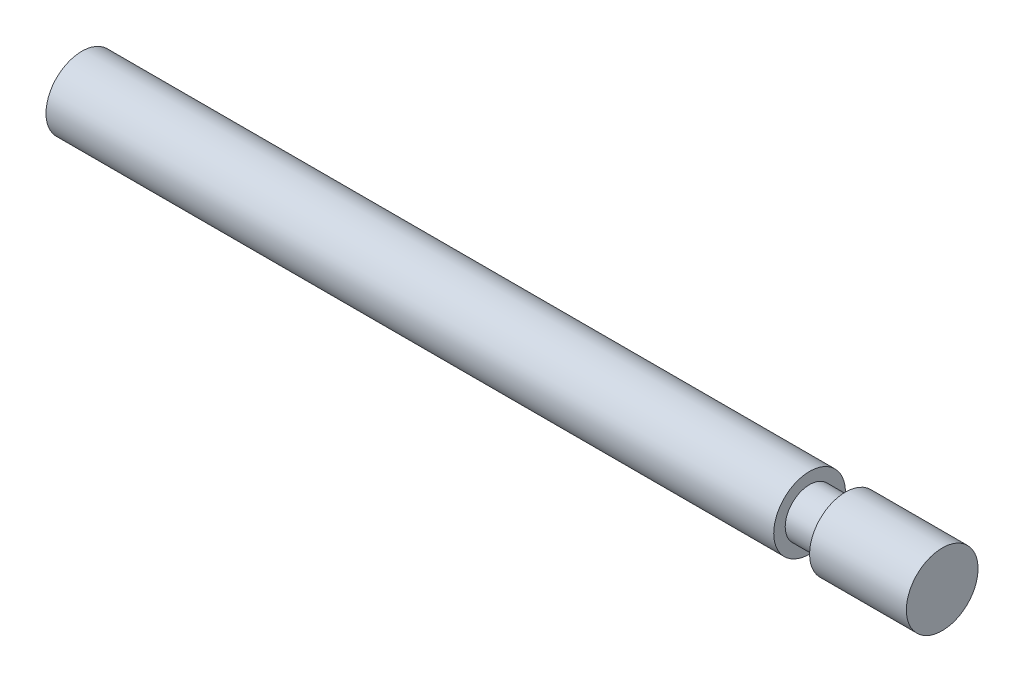
ISO-10303-21;
HEADER;
FILE_DESCRIPTION(('STEP AP214'),'2;1');
FILE_NAME('part.step','',(''),(''),'','','');
FILE_SCHEMA(('AUTOMOTIVE_DESIGN { 1 0 10303 214 1 1 1 1 }'));
ENDSEC;
DATA;
#1=APPLICATION_CONTEXT('core data for automotive mechanical design processes');
#2=APPLICATION_PROTOCOL_DEFINITION('international standard','automotive_design',2000,#1);
#3=PRODUCT_CONTEXT('',#1,'mechanical');
#4=PRODUCT('Part','Part','',(#3));
#5=PRODUCT_RELATED_PRODUCT_CATEGORY('part','',(#4));
#6=PRODUCT_DEFINITION_FORMATION('','',#4);
#7=PRODUCT_DEFINITION_CONTEXT('part definition',#1,'design');
#8=PRODUCT_DEFINITION('design','',#6,#7);
#9=PRODUCT_DEFINITION_SHAPE('','',#8);
#10=(LENGTH_UNIT() NAMED_UNIT(*) SI_UNIT(.MILLI.,.METRE.));
#11=(NAMED_UNIT(*) PLANE_ANGLE_UNIT() SI_UNIT($,.RADIAN.));
#12=(NAMED_UNIT(*) SI_UNIT($,.STERADIAN.) SOLID_ANGLE_UNIT());
#13=UNCERTAINTY_MEASURE_WITH_UNIT(LENGTH_MEASURE(1.E-05),#10,'distance_accuracy_value','');
#14=(GEOMETRIC_REPRESENTATION_CONTEXT(3) GLOBAL_UNCERTAINTY_ASSIGNED_CONTEXT((#13)) GLOBAL_UNIT_ASSIGNED_CONTEXT((#10,
#11,#12)) REPRESENTATION_CONTEXT('',''));
#15=CARTESIAN_POINT('',(0.,0.,0.));
#16=DIRECTION('',(0.,0.,1.));
#17=DIRECTION('',(1.,0.,0.));
#18=AXIS2_PLACEMENT_3D('',#15,#16,#17);
#19=CARTESIAN_POINT('',(-60.,0.,0.));
#20=DIRECTION('',(-1.,0.,0.));
#21=DIRECTION('',(0.,0.,1.));
#22=AXIS2_PLACEMENT_3D('',#19,#20,#21);
#23=PLANE('',#22);
#24=CARTESIAN_POINT('',(-60.,0.,0.));
#25=DIRECTION('',(-1.,0.,0.));
#26=DIRECTION('',(0.,0.,1.));
#27=AXIS2_PLACEMENT_3D('',#24,#25,#26);
#28=CIRCLE('',#27,2.5);
#29=CARTESIAN_POINT('',(-60.,0.,2.5));
#30=VERTEX_POINT('',#29);
#31=EDGE_CURVE('E10',#30,#30,#28,.T.);
#32=ORIENTED_EDGE('',*,*,#31,.T.);
#33=EDGE_LOOP('',(#32));
#34=FACE_BOUND('',#33,.T.);
#35=ADVANCED_FACE('F30',(#34),#23,.T.);
#36=CARTESIAN_POINT('',(-67.033685718413,0.,0.));
#37=DIRECTION('',(-1.,0.,0.));
#38=DIRECTION('',(0.,0.,1.));
#39=AXIS2_PLACEMENT_3D('',#36,#37,#38);
#40=CYLINDRICAL_SURFACE('',#39,2.5);
#41=CARTESIAN_POINT('',(-9.25,0.,0.));
#42=DIRECTION('',(-1.,0.,0.));
#43=DIRECTION('',(0.,0.,1.));
#44=AXIS2_PLACEMENT_3D('',#41,#42,#43);
#45=CIRCLE('',#44,2.5);
#46=CARTESIAN_POINT('',(-9.25,0.,2.5));
#47=VERTEX_POINT('',#46);
#48=EDGE_CURVE('E36',#47,#47,#45,.T.);
#49=ORIENTED_EDGE('',*,*,#48,.T.);
#50=EDGE_LOOP('',(#49));
#51=FACE_BOUND('',#50,.T.);
#52=ORIENTED_EDGE('',*,*,#31,.F.);
#53=EDGE_LOOP('',(#52));
#54=FACE_BOUND('',#53,.T.);
#55=ADVANCED_FACE('F68',(#51,#54),#40,.T.);
#56=CARTESIAN_POINT('',(-9.25,0.,2.5));
#57=DIRECTION('',(1.,0.,0.));
#58=DIRECTION('',(0.,0.,-1.));
#59=AXIS2_PLACEMENT_3D('',#56,#57,#58);
#60=PLANE('',#59);
#61=CARTESIAN_POINT('',(-9.25,0.,0.));
#62=DIRECTION('',(-1.,0.,0.));
#63=DIRECTION('',(0.,0.,1.));
#64=AXIS2_PLACEMENT_3D('',#61,#62,#63);
#65=CIRCLE('',#64,1.7);
#66=CARTESIAN_POINT('',(-9.25,0.,1.7));
#67=VERTEX_POINT('',#66);
#68=EDGE_CURVE('E40',#67,#67,#65,.T.);
#69=ORIENTED_EDGE('',*,*,#68,.T.);
#70=EDGE_LOOP('',(#69));
#71=FACE_BOUND('',#70,.T.);
#72=ORIENTED_EDGE('',*,*,#48,.F.);
#73=EDGE_LOOP('',(#72));
#74=FACE_BOUND('',#73,.T.);
#75=ADVANCED_FACE('F72',(#71,#74),#60,.T.);
#76=CARTESIAN_POINT('',(-67.033685718413,0.,0.));
#77=DIRECTION('',(-1.,0.,0.));
#78=DIRECTION('',(0.,0.,1.));
#79=AXIS2_PLACEMENT_3D('',#76,#77,#78);
#80=CYLINDRICAL_SURFACE('',#79,1.7);
#81=CARTESIAN_POINT('',(-6.75,0.,0.));
#82=DIRECTION('',(-1.,0.,0.));
#83=DIRECTION('',(0.,0.,1.));
#84=AXIS2_PLACEMENT_3D('',#81,#82,#83);
#85=CIRCLE('',#84,1.7);
#86=CARTESIAN_POINT('',(-6.75,0.,1.7));
#87=VERTEX_POINT('',#86);
#88=EDGE_CURVE('E44',#87,#87,#85,.T.);
#89=ORIENTED_EDGE('',*,*,#88,.T.);
#90=EDGE_LOOP('',(#89));
#91=FACE_BOUND('',#90,.T.);
#92=ORIENTED_EDGE('',*,*,#68,.F.);
#93=EDGE_LOOP('',(#92));
#94=FACE_BOUND('',#93,.T.);
#95=ADVANCED_FACE('F76',(#91,#94),#80,.T.);
#96=CARTESIAN_POINT('',(-6.75,0.,1.7));
#97=DIRECTION('',(-1.,0.,0.));
#98=DIRECTION('',(0.,0.,1.));
#99=AXIS2_PLACEMENT_3D('',#96,#97,#98);
#100=PLANE('',#99);
#101=CARTESIAN_POINT('',(-6.75,0.,0.));
#102=DIRECTION('',(-1.,0.,0.));
#103=DIRECTION('',(0.,0.,1.));
#104=AXIS2_PLACEMENT_3D('',#101,#102,#103);
#105=CIRCLE('',#104,2.5);
#106=CARTESIAN_POINT('',(-6.75,0.,2.5));
#107=VERTEX_POINT('',#106);
#108=EDGE_CURVE('E49',#107,#107,#105,.T.);
#109=ORIENTED_EDGE('',*,*,#108,.T.);
#110=EDGE_LOOP('',(#109));
#111=FACE_BOUND('',#110,.T.);
#112=ORIENTED_EDGE('',*,*,#88,.F.);
#113=EDGE_LOOP('',(#112));
#114=FACE_BOUND('',#113,.T.);
#115=ADVANCED_FACE('F65',(#111,#114),#100,.T.);
#116=CARTESIAN_POINT('',(-67.033685718413,0.,0.));
#117=DIRECTION('',(-1.,0.,0.));
#118=DIRECTION('',(0.,0.,1.));
#119=AXIS2_PLACEMENT_3D('',#116,#117,#118);
#120=CYLINDRICAL_SURFACE('',#119,2.5);
#121=CARTESIAN_POINT('',(0.,0.,0.));
#122=DIRECTION('',(-1.,0.,0.));
#123=DIRECTION('',(0.,0.,1.));
#124=AXIS2_PLACEMENT_3D('',#121,#122,#123);
#125=CIRCLE('',#124,2.5);
#126=CARTESIAN_POINT('',(0.,0.,2.5));
#127=VERTEX_POINT('',#126);
#128=EDGE_CURVE('E52',#127,#127,#125,.T.);
#129=ORIENTED_EDGE('',*,*,#128,.T.);
#130=EDGE_LOOP('',(#129));
#131=FACE_BOUND('',#130,.T.);
#132=ORIENTED_EDGE('',*,*,#108,.F.);
#133=EDGE_LOOP('',(#132));
#134=FACE_BOUND('',#133,.T.);
#135=ADVANCED_FACE('F56',(#131,#134),#120,.T.);
#136=CARTESIAN_POINT('',(0.,0.,2.5));
#137=DIRECTION('',(1.,0.,0.));
#138=DIRECTION('',(0.,0.,-1.));
#139=AXIS2_PLACEMENT_3D('',#136,#137,#138);
#140=PLANE('',#139);
#141=ORIENTED_EDGE('',*,*,#128,.F.);
#142=EDGE_LOOP('',(#141));
#143=FACE_BOUND('',#142,.T.);
#144=ADVANCED_FACE('F59',(#143),#140,.T.);
#145=CLOSED_SHELL('',(#35,#55,#75,#95,#115,#135,#144));
#146=MANIFOLD_SOLID_BREP('B2',#145);
#147=ADVANCED_BREP_SHAPE_REPRESENTATION('',(#18,#146),#14);
#148=SHAPE_DEFINITION_REPRESENTATION(#9,#147);
ENDSEC;
END-ISO-10303-21;
